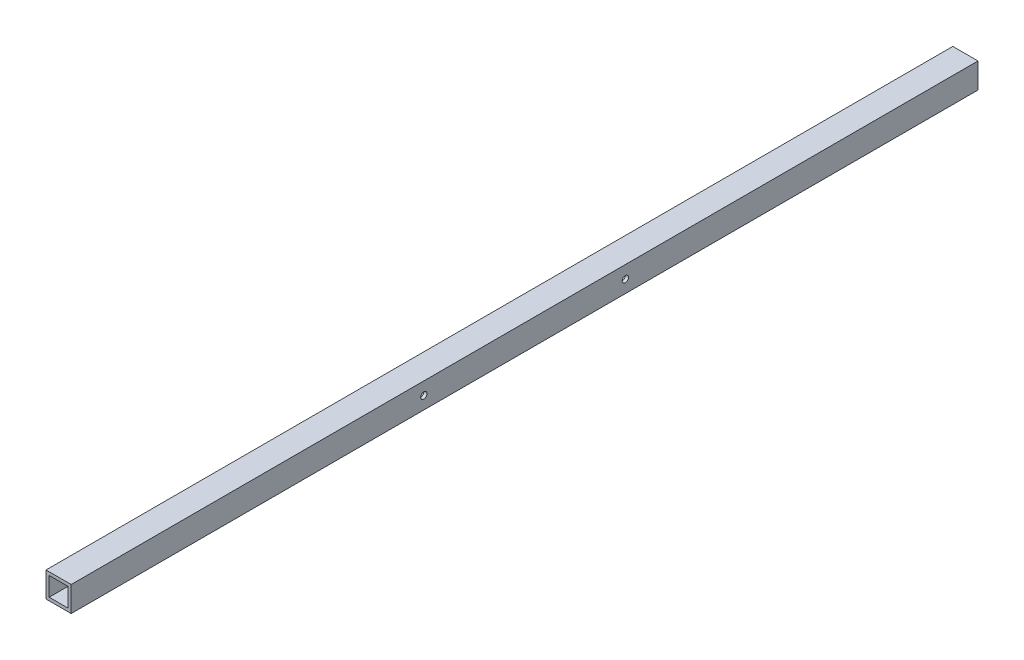
ISO-10303-21;
HEADER;
FILE_DESCRIPTION(('STEP AP214'),'2;1');
FILE_NAME('part.step','',(''),(''),'','','');
FILE_SCHEMA(('AUTOMOTIVE_DESIGN { 1 0 10303 214 1 1 1 1 }'));
ENDSEC;
DATA;
#1=APPLICATION_CONTEXT('core data for automotive mechanical design processes');
#2=APPLICATION_PROTOCOL_DEFINITION('international standard','automotive_design',2000,#1);
#3=PRODUCT_CONTEXT('',#1,'mechanical');
#4=PRODUCT('Part','Part','',(#3));
#5=PRODUCT_RELATED_PRODUCT_CATEGORY('part','',(#4));
#6=PRODUCT_DEFINITION_FORMATION('','',#4);
#7=PRODUCT_DEFINITION_CONTEXT('part definition',#1,'design');
#8=PRODUCT_DEFINITION('design','',#6,#7);
#9=PRODUCT_DEFINITION_SHAPE('','',#8);
#10=(LENGTH_UNIT() NAMED_UNIT(*) SI_UNIT(.MILLI.,.METRE.));
#11=(NAMED_UNIT(*) PLANE_ANGLE_UNIT() SI_UNIT($,.RADIAN.));
#12=(NAMED_UNIT(*) SI_UNIT($,.STERADIAN.) SOLID_ANGLE_UNIT());
#13=UNCERTAINTY_MEASURE_WITH_UNIT(LENGTH_MEASURE(1.E-05),#10,'distance_accuracy_value','');
#14=(GEOMETRIC_REPRESENTATION_CONTEXT(3) GLOBAL_UNCERTAINTY_ASSIGNED_CONTEXT((#13)) GLOBAL_UNIT_ASSIGNED_CONTEXT((#10,
#11,#12)) REPRESENTATION_CONTEXT('',''));
#15=CARTESIAN_POINT('',(0.,0.,0.));
#16=DIRECTION('',(0.,0.,1.));
#17=DIRECTION('',(1.,0.,0.));
#18=AXIS2_PLACEMENT_3D('',#15,#16,#17);
#19=CARTESIAN_POINT('',(0.,0.,914.4));
#20=DIRECTION('',(0.,0.,1.));
#21=DIRECTION('',(1.,0.,0.));
#22=AXIS2_PLACEMENT_3D('',#19,#20,#21);
#23=PLANE('',#22);
#24=DIRECTION('',(0.,1.,0.));
#25=VECTOR('',#24,1.);
#26=CARTESIAN_POINT('',(12.7,12.7,914.4));
#27=LINE('',#26,#25);
#28=CARTESIAN_POINT('',(12.7,-12.7,914.4));
#29=VERTEX_POINT('',#28);
#30=CARTESIAN_POINT('',(12.7,12.7,914.4));
#31=VERTEX_POINT('',#30);
#32=EDGE_CURVE('E138',#29,#31,#27,.T.);
#33=ORIENTED_EDGE('',*,*,#32,.T.);
#34=DIRECTION('',(-1.,0.,0.));
#35=VECTOR('',#34,1.);
#36=CARTESIAN_POINT('',(-12.7,12.7,914.4));
#37=LINE('',#36,#35);
#38=CARTESIAN_POINT('',(-12.7,12.7,914.4));
#39=VERTEX_POINT('',#38);
#40=EDGE_CURVE('E141',#31,#39,#37,.T.);
#41=ORIENTED_EDGE('',*,*,#40,.T.);
#42=DIRECTION('',(0.,-1.,0.));
#43=VECTOR('',#42,1.);
#44=CARTESIAN_POINT('',(-12.7,12.7,914.4));
#45=LINE('',#44,#43);
#46=CARTESIAN_POINT('',(-12.7,-12.7,914.4));
#47=VERTEX_POINT('',#46);
#48=EDGE_CURVE('E144',#39,#47,#45,.T.);
#49=ORIENTED_EDGE('',*,*,#48,.T.);
#50=DIRECTION('',(1.,0.,0.));
#51=VECTOR('',#50,1.);
#52=CARTESIAN_POINT('',(-12.7,-12.7,914.4));
#53=LINE('',#52,#51);
#54=EDGE_CURVE('E146',#47,#29,#53,.T.);
#55=ORIENTED_EDGE('',*,*,#54,.T.);
#56=EDGE_LOOP('',(#33,#41,#49,#55));
#57=FACE_BOUND('',#56,.T.);
#58=DIRECTION('',(-1.,0.,0.));
#59=VECTOR('',#58,1.);
#60=CARTESIAN_POINT('',(-9.525,9.525,914.4));
#61=LINE('',#60,#59);
#62=CARTESIAN_POINT('',(9.525,9.525,914.4));
#63=VERTEX_POINT('',#62);
#64=CARTESIAN_POINT('',(-9.525,9.525,914.4));
#65=VERTEX_POINT('',#64);
#66=EDGE_CURVE('E108',#63,#65,#61,.T.);
#67=ORIENTED_EDGE('',*,*,#66,.F.);
#68=DIRECTION('',(0.,1.,0.));
#69=VECTOR('',#68,1.);
#70=CARTESIAN_POINT('',(9.525,9.525,914.4));
#71=LINE('',#70,#69);
#72=CARTESIAN_POINT('',(9.525,-9.525,914.4));
#73=VERTEX_POINT('',#72);
#74=EDGE_CURVE('E100',#73,#63,#71,.T.);
#75=ORIENTED_EDGE('',*,*,#74,.F.);
#76=DIRECTION('',(1.,0.,0.));
#77=VECTOR('',#76,1.);
#78=CARTESIAN_POINT('',(-9.525,-9.525,914.4));
#79=LINE('',#78,#77);
#80=CARTESIAN_POINT('',(-9.525,-9.525,914.4));
#81=VERTEX_POINT('',#80);
#82=EDGE_CURVE('E122',#81,#73,#79,.T.);
#83=ORIENTED_EDGE('',*,*,#82,.F.);
#84=DIRECTION('',(0.,-1.,0.));
#85=VECTOR('',#84,1.);
#86=CARTESIAN_POINT('',(-9.525,9.525,914.4));
#87=LINE('',#86,#85);
#88=EDGE_CURVE('E120',#65,#81,#87,.T.);
#89=ORIENTED_EDGE('',*,*,#88,.F.);
#90=EDGE_LOOP('',(#67,#75,#83,#89));
#91=FACE_BOUND('',#90,.T.);
#92=ADVANCED_FACE('F33',(#57,#91),#23,.T.);
#93=CARTESIAN_POINT('',(0.,0.,0.));
#94=DIRECTION('',(0.,0.,1.));
#95=DIRECTION('',(1.,0.,0.));
#96=AXIS2_PLACEMENT_3D('',#93,#94,#95);
#97=PLANE('',#96);
#98=DIRECTION('',(0.,1.,0.));
#99=VECTOR('',#98,1.);
#100=CARTESIAN_POINT('',(12.7,12.7,0.));
#101=LINE('',#100,#99);
#102=CARTESIAN_POINT('',(12.7,-12.7,0.));
#103=VERTEX_POINT('',#102);
#104=CARTESIAN_POINT('',(12.7,12.7,0.));
#105=VERTEX_POINT('',#104);
#106=EDGE_CURVE('E116',#103,#105,#101,.T.);
#107=ORIENTED_EDGE('',*,*,#106,.F.);
#108=DIRECTION('',(1.,0.,0.));
#109=VECTOR('',#108,1.);
#110=CARTESIAN_POINT('',(-12.7,-12.7,0.));
#111=LINE('',#110,#109);
#112=CARTESIAN_POINT('',(-12.7,-12.7,0.));
#113=VERTEX_POINT('',#112);
#114=EDGE_CURVE('E142',#113,#103,#111,.T.);
#115=ORIENTED_EDGE('',*,*,#114,.F.);
#116=DIRECTION('',(0.,-1.,0.));
#117=VECTOR('',#116,1.);
#118=CARTESIAN_POINT('',(-12.7,12.7,0.));
#119=LINE('',#118,#117);
#120=CARTESIAN_POINT('',(-12.7,12.7,0.));
#121=VERTEX_POINT('',#120);
#122=EDGE_CURVE('E153',#121,#113,#119,.T.);
#123=ORIENTED_EDGE('',*,*,#122,.F.);
#124=DIRECTION('',(-1.,0.,0.));
#125=VECTOR('',#124,1.);
#126=CARTESIAN_POINT('',(-12.7,12.7,0.));
#127=LINE('',#126,#125);
#128=EDGE_CURVE('E151',#105,#121,#127,.T.);
#129=ORIENTED_EDGE('',*,*,#128,.F.);
#130=EDGE_LOOP('',(#107,#115,#123,#129));
#131=FACE_BOUND('',#130,.T.);
#132=DIRECTION('',(0.,1.,0.));
#133=VECTOR('',#132,1.);
#134=CARTESIAN_POINT('',(9.525,9.525,0.));
#135=LINE('',#134,#133);
#136=CARTESIAN_POINT('',(9.525,-9.525,0.));
#137=VERTEX_POINT('',#136);
#138=CARTESIAN_POINT('',(9.525,9.525,0.));
#139=VERTEX_POINT('',#138);
#140=EDGE_CURVE('E58',#137,#139,#135,.T.);
#141=ORIENTED_EDGE('',*,*,#140,.T.);
#142=DIRECTION('',(-1.,0.,0.));
#143=VECTOR('',#142,1.);
#144=CARTESIAN_POINT('',(-9.525,9.525,0.));
#145=LINE('',#144,#143);
#146=CARTESIAN_POINT('',(-9.525,9.525,0.));
#147=VERTEX_POINT('',#146);
#148=EDGE_CURVE('E115',#139,#147,#145,.T.);
#149=ORIENTED_EDGE('',*,*,#148,.T.);
#150=DIRECTION('',(0.,-1.,0.));
#151=VECTOR('',#150,1.);
#152=CARTESIAN_POINT('',(-9.525,9.525,0.));
#153=LINE('',#152,#151);
#154=CARTESIAN_POINT('',(-9.525,-9.525,0.));
#155=VERTEX_POINT('',#154);
#156=EDGE_CURVE('E130',#147,#155,#153,.T.);
#157=ORIENTED_EDGE('',*,*,#156,.T.);
#158=DIRECTION('',(1.,0.,0.));
#159=VECTOR('',#158,1.);
#160=CARTESIAN_POINT('',(-9.525,-9.525,0.));
#161=LINE('',#160,#159);
#162=EDGE_CURVE('E109',#155,#137,#161,.T.);
#163=ORIENTED_EDGE('',*,*,#162,.T.);
#164=EDGE_LOOP('',(#141,#149,#157,#163));
#165=FACE_BOUND('',#164,.T.);
#166=ADVANCED_FACE('F200',(#131,#165),#97,.F.);
#167=CARTESIAN_POINT('',(12.7,12.7,914.4));
#168=DIRECTION('',(-1.,0.,0.));
#169=DIRECTION('',(0.,-1.,0.));
#170=AXIS2_PLACEMENT_3D('',#167,#168,#169);
#171=PLANE('',#170);
#172=CARTESIAN_POINT('',(12.7,0.,355.6));
#173=DIRECTION('',(1.,0.,0.));
#174=DIRECTION('',(0.,-1.,0.));
#175=AXIS2_PLACEMENT_3D('',#172,#173,#174);
#176=CIRCLE('',#175,3.17500000000008);
#177=CARTESIAN_POINT('',(12.7,-3.17500000000009,355.6));
#178=VERTEX_POINT('',#177);
#179=EDGE_CURVE('E179',#178,#178,#176,.T.);
#180=ORIENTED_EDGE('',*,*,#179,.F.);
#181=EDGE_LOOP('',(#180));
#182=FACE_BOUND('',#181,.T.);
#183=CARTESIAN_POINT('',(12.7,0.,558.8));
#184=DIRECTION('',(1.,0.,0.));
#185=DIRECTION('',(0.,1.,0.));
#186=AXIS2_PLACEMENT_3D('',#183,#184,#185);
#187=CIRCLE('',#186,3.17500000000008);
#188=CARTESIAN_POINT('',(12.7,3.17500000000007,558.8));
#189=VERTEX_POINT('',#188);
#190=EDGE_CURVE('E169',#189,#189,#187,.T.);
#191=ORIENTED_EDGE('',*,*,#190,.F.);
#192=EDGE_LOOP('',(#191));
#193=FACE_BOUND('',#192,.T.);
#194=ORIENTED_EDGE('',*,*,#106,.T.);
#195=DIRECTION('',(0.,0.,-1.));
#196=VECTOR('',#195,1.);
#197=CARTESIAN_POINT('',(12.7,12.7,914.4));
#198=LINE('',#197,#196);
#199=EDGE_CURVE('E11',#31,#105,#198,.T.);
#200=ORIENTED_EDGE('',*,*,#199,.F.);
#201=ORIENTED_EDGE('',*,*,#32,.F.);
#202=DIRECTION('',(0.,0.,-1.));
#203=VECTOR('',#202,1.);
#204=CARTESIAN_POINT('',(12.7,-12.7,914.4));
#205=LINE('',#204,#203);
#206=EDGE_CURVE('E148',#29,#103,#205,.T.);
#207=ORIENTED_EDGE('',*,*,#206,.T.);
#208=EDGE_LOOP('',(#194,#200,#201,#207));
#209=FACE_BOUND('',#208,.T.);
#210=ADVANCED_FACE('F35',(#182,#193,#209),#171,.F.);
#211=CARTESIAN_POINT('',(-12.7,12.7,914.4));
#212=DIRECTION('',(0.,-1.,0.));
#213=DIRECTION('',(0.,0.,-1.));
#214=AXIS2_PLACEMENT_3D('',#211,#212,#213);
#215=PLANE('',#214);
#216=ORIENTED_EDGE('',*,*,#128,.T.);
#217=DIRECTION('',(0.,0.,-1.));
#218=VECTOR('',#217,1.);
#219=CARTESIAN_POINT('',(-12.7,12.7,914.4));
#220=LINE('',#219,#218);
#221=EDGE_CURVE('E42',#39,#121,#220,.T.);
#222=ORIENTED_EDGE('',*,*,#221,.F.);
#223=ORIENTED_EDGE('',*,*,#40,.F.);
#224=ORIENTED_EDGE('',*,*,#199,.T.);
#225=EDGE_LOOP('',(#216,#222,#223,#224));
#226=FACE_BOUND('',#225,.T.);
#227=ADVANCED_FACE('F226',(#226),#215,.F.);
#228=CARTESIAN_POINT('',(-12.7,12.7,914.4));
#229=DIRECTION('',(1.,0.,0.));
#230=DIRECTION('',(0.,1.,0.));
#231=AXIS2_PLACEMENT_3D('',#228,#229,#230);
#232=PLANE('',#231);
#233=CARTESIAN_POINT('',(-12.7,0.,355.6));
#234=DIRECTION('',(1.,0.,0.));
#235=DIRECTION('',(0.,-1.,0.));
#236=AXIS2_PLACEMENT_3D('',#233,#234,#235);
#237=CIRCLE('',#236,3.17500000000008);
#238=CARTESIAN_POINT('',(-12.7,-3.1750000000001,355.6));
#239=VERTEX_POINT('',#238);
#240=EDGE_CURVE('E182',#239,#239,#237,.T.);
#241=ORIENTED_EDGE('',*,*,#240,.T.);
#242=EDGE_LOOP('',(#241));
#243=FACE_BOUND('',#242,.T.);
#244=CARTESIAN_POINT('',(-12.7,0.,558.8));
#245=DIRECTION('',(1.,0.,0.));
#246=DIRECTION('',(0.,1.,0.));
#247=AXIS2_PLACEMENT_3D('',#244,#245,#246);
#248=CIRCLE('',#247,3.17500000000008);
#249=CARTESIAN_POINT('',(-12.7,3.17500000000007,558.8));
#250=VERTEX_POINT('',#249);
#251=EDGE_CURVE('E164',#250,#250,#248,.T.);
#252=ORIENTED_EDGE('',*,*,#251,.T.);
#253=EDGE_LOOP('',(#252));
#254=FACE_BOUND('',#253,.T.);
#255=ORIENTED_EDGE('',*,*,#122,.T.);
#256=DIRECTION('',(0.,0.,-1.));
#257=VECTOR('',#256,1.);
#258=CARTESIAN_POINT('',(-12.7,-12.7,914.4));
#259=LINE('',#258,#257);
#260=EDGE_CURVE('E158',#47,#113,#259,.T.);
#261=ORIENTED_EDGE('',*,*,#260,.F.);
#262=ORIENTED_EDGE('',*,*,#48,.F.);
#263=ORIENTED_EDGE('',*,*,#221,.T.);
#264=EDGE_LOOP('',(#255,#261,#262,#263));
#265=FACE_BOUND('',#264,.T.);
#266=ADVANCED_FACE('F223',(#243,#254,#265),#232,.F.);
#267=CARTESIAN_POINT('',(-12.7,-12.7,914.4));
#268=DIRECTION('',(0.,1.,0.));
#269=DIRECTION('',(0.,0.,1.));
#270=AXIS2_PLACEMENT_3D('',#267,#268,#269);
#271=PLANE('',#270);
#272=ORIENTED_EDGE('',*,*,#114,.T.);
#273=ORIENTED_EDGE('',*,*,#206,.F.);
#274=ORIENTED_EDGE('',*,*,#54,.F.);
#275=ORIENTED_EDGE('',*,*,#260,.T.);
#276=EDGE_LOOP('',(#272,#273,#274,#275));
#277=FACE_BOUND('',#276,.T.);
#278=ADVANCED_FACE('F220',(#277),#271,.F.);
#279=CARTESIAN_POINT('',(9.525,9.525,914.4));
#280=DIRECTION('',(-1.,0.,0.));
#281=DIRECTION('',(0.,0.,1.));
#282=AXIS2_PLACEMENT_3D('',#279,#280,#281);
#283=PLANE('',#282);
#284=CARTESIAN_POINT('',(9.525,0.,355.6));
#285=DIRECTION('',(-1.,0.,0.));
#286=DIRECTION('',(0.,0.,1.));
#287=AXIS2_PLACEMENT_3D('',#284,#285,#286);
#288=CIRCLE('',#287,3.17500000000008);
#289=CARTESIAN_POINT('',(9.525,0.,358.775));
#290=VERTEX_POINT('',#289);
#291=EDGE_CURVE('E174',#290,#290,#288,.T.);
#292=ORIENTED_EDGE('',*,*,#291,.F.);
#293=EDGE_LOOP('',(#292));
#294=FACE_BOUND('',#293,.T.);
#295=CARTESIAN_POINT('',(9.525,0.,558.8));
#296=DIRECTION('',(-1.,0.,0.));
#297=DIRECTION('',(0.,0.,1.));
#298=AXIS2_PLACEMENT_3D('',#295,#296,#297);
#299=CIRCLE('',#298,3.17500000000008);
#300=CARTESIAN_POINT('',(9.525,0.,561.975));
#301=VERTEX_POINT('',#300);
#302=EDGE_CURVE('E128',#301,#301,#299,.T.);
#303=ORIENTED_EDGE('',*,*,#302,.F.);
#304=EDGE_LOOP('',(#303));
#305=FACE_BOUND('',#304,.T.);
#306=ORIENTED_EDGE('',*,*,#140,.F.);
#307=DIRECTION('',(0.,0.,-1.));
#308=VECTOR('',#307,1.);
#309=CARTESIAN_POINT('',(9.525,-9.525,914.4));
#310=LINE('',#309,#308);
#311=EDGE_CURVE('E104',#73,#137,#310,.T.);
#312=ORIENTED_EDGE('',*,*,#311,.F.);
#313=ORIENTED_EDGE('',*,*,#74,.T.);
#314=DIRECTION('',(0.,0.,-1.));
#315=VECTOR('',#314,1.);
#316=CARTESIAN_POINT('',(9.525,9.525,914.4));
#317=LINE('',#316,#315);
#318=EDGE_CURVE('E103',#63,#139,#317,.T.);
#319=ORIENTED_EDGE('',*,*,#318,.T.);
#320=EDGE_LOOP('',(#306,#312,#313,#319));
#321=FACE_BOUND('',#320,.T.);
#322=ADVANCED_FACE('F102',(#294,#305,#321),#283,.T.);
#323=CARTESIAN_POINT('',(-9.525,9.525,914.4));
#324=DIRECTION('',(0.,-1.,0.));
#325=DIRECTION('',(0.,0.,-1.));
#326=AXIS2_PLACEMENT_3D('',#323,#324,#325);
#327=PLANE('',#326);
#328=ORIENTED_EDGE('',*,*,#148,.F.);
#329=ORIENTED_EDGE('',*,*,#318,.F.);
#330=ORIENTED_EDGE('',*,*,#66,.T.);
#331=DIRECTION('',(0.,0.,-1.));
#332=VECTOR('',#331,1.);
#333=CARTESIAN_POINT('',(-9.525,9.525,914.4));
#334=LINE('',#333,#332);
#335=EDGE_CURVE('E117',#65,#147,#334,.T.);
#336=ORIENTED_EDGE('',*,*,#335,.T.);
#337=EDGE_LOOP('',(#328,#329,#330,#336));
#338=FACE_BOUND('',#337,.T.);
#339=ADVANCED_FACE('F112',(#338),#327,.T.);
#340=CARTESIAN_POINT('',(-9.525,9.525,914.4));
#341=DIRECTION('',(1.,0.,0.));
#342=DIRECTION('',(0.,0.,-1.));
#343=AXIS2_PLACEMENT_3D('',#340,#341,#342);
#344=PLANE('',#343);
#345=CARTESIAN_POINT('',(-9.525,0.,355.6));
#346=DIRECTION('',(1.,0.,0.));
#347=DIRECTION('',(0.,0.,-1.));
#348=AXIS2_PLACEMENT_3D('',#345,#346,#347);
#349=CIRCLE('',#348,3.17500000000008);
#350=CARTESIAN_POINT('',(-9.525,0.,352.425));
#351=VERTEX_POINT('',#350);
#352=EDGE_CURVE('E37',#351,#351,#349,.T.);
#353=ORIENTED_EDGE('',*,*,#352,.F.);
#354=EDGE_LOOP('',(#353));
#355=FACE_BOUND('',#354,.T.);
#356=CARTESIAN_POINT('',(-9.525,0.,558.8));
#357=DIRECTION('',(1.,0.,0.));
#358=DIRECTION('',(0.,0.,-1.));
#359=AXIS2_PLACEMENT_3D('',#356,#357,#358);
#360=CIRCLE('',#359,3.17500000000008);
#361=CARTESIAN_POINT('',(-9.525,0.,555.625));
#362=VERTEX_POINT('',#361);
#363=EDGE_CURVE('E162',#362,#362,#360,.T.);
#364=ORIENTED_EDGE('',*,*,#363,.F.);
#365=EDGE_LOOP('',(#364));
#366=FACE_BOUND('',#365,.T.);
#367=ORIENTED_EDGE('',*,*,#156,.F.);
#368=ORIENTED_EDGE('',*,*,#335,.F.);
#369=ORIENTED_EDGE('',*,*,#88,.T.);
#370=DIRECTION('',(0.,0.,-1.));
#371=VECTOR('',#370,1.);
#372=CARTESIAN_POINT('',(-9.525,-9.525,914.4));
#373=LINE('',#372,#371);
#374=EDGE_CURVE('E50',#81,#155,#373,.T.);
#375=ORIENTED_EDGE('',*,*,#374,.T.);
#376=EDGE_LOOP('',(#367,#368,#369,#375));
#377=FACE_BOUND('',#376,.T.);
#378=ADVANCED_FACE('F192',(#355,#366,#377),#344,.T.);
#379=CARTESIAN_POINT('',(-9.525,-9.525,914.4));
#380=DIRECTION('',(0.,1.,0.));
#381=DIRECTION('',(0.,0.,1.));
#382=AXIS2_PLACEMENT_3D('',#379,#380,#381);
#383=PLANE('',#382);
#384=ORIENTED_EDGE('',*,*,#162,.F.);
#385=ORIENTED_EDGE('',*,*,#374,.F.);
#386=ORIENTED_EDGE('',*,*,#82,.T.);
#387=ORIENTED_EDGE('',*,*,#311,.T.);
#388=EDGE_LOOP('',(#384,#385,#386,#387));
#389=FACE_BOUND('',#388,.T.);
#390=ADVANCED_FACE('F195',(#389),#383,.T.);
#391=CARTESIAN_POINT('',(-12.7,0.,558.8));
#392=DIRECTION('',(1.,0.,0.));
#393=DIRECTION('',(0.,1.,0.));
#394=AXIS2_PLACEMENT_3D('',#391,#392,#393);
#395=CYLINDRICAL_SURFACE('',#394,3.17500000000008);
#396=ORIENTED_EDGE('',*,*,#363,.T.);
#397=EDGE_LOOP('',(#396));
#398=FACE_BOUND('',#397,.T.);
#399=ORIENTED_EDGE('',*,*,#251,.F.);
#400=EDGE_LOOP('',(#399));
#401=FACE_BOUND('',#400,.T.);
#402=ADVANCED_FACE('F202',(#398,#401),#395,.F.);
#403=ORIENTED_EDGE('',*,*,#302,.T.);
#404=EDGE_LOOP('',(#403));
#405=FACE_BOUND('',#404,.T.);
#406=ORIENTED_EDGE('',*,*,#190,.T.);
#407=EDGE_LOOP('',(#406));
#408=FACE_BOUND('',#407,.T.);
#409=ADVANCED_FACE('F207',(#405,#408),#395,.F.);
#410=CARTESIAN_POINT('',(-12.7,0.,355.6));
#411=DIRECTION('',(1.,0.,0.));
#412=DIRECTION('',(0.,1.,0.));
#413=AXIS2_PLACEMENT_3D('',#410,#411,#412);
#414=CYLINDRICAL_SURFACE('',#413,3.17500000000008);
#415=ORIENTED_EDGE('',*,*,#352,.T.);
#416=EDGE_LOOP('',(#415));
#417=FACE_BOUND('',#416,.T.);
#418=ORIENTED_EDGE('',*,*,#240,.F.);
#419=EDGE_LOOP('',(#418));
#420=FACE_BOUND('',#419,.T.);
#421=ADVANCED_FACE('F189',(#417,#420),#414,.F.);
#422=ORIENTED_EDGE('',*,*,#291,.T.);
#423=EDGE_LOOP('',(#422));
#424=FACE_BOUND('',#423,.T.);
#425=ORIENTED_EDGE('',*,*,#179,.T.);
#426=EDGE_LOOP('',(#425));
#427=FACE_BOUND('',#426,.T.);
#428=ADVANCED_FACE('F256',(#424,#427),#414,.F.);
#429=CLOSED_SHELL('',(#92,#166,#210,#227,#266,#278,#322,#339,#378,#390,#402,#409,#421,#428));
#430=MANIFOLD_SOLID_BREP('B2',#429);
#431=ADVANCED_BREP_SHAPE_REPRESENTATION('',(#18,#430),#14);
#432=SHAPE_DEFINITION_REPRESENTATION(#9,#431);
ENDSEC;
END-ISO-10303-21;
